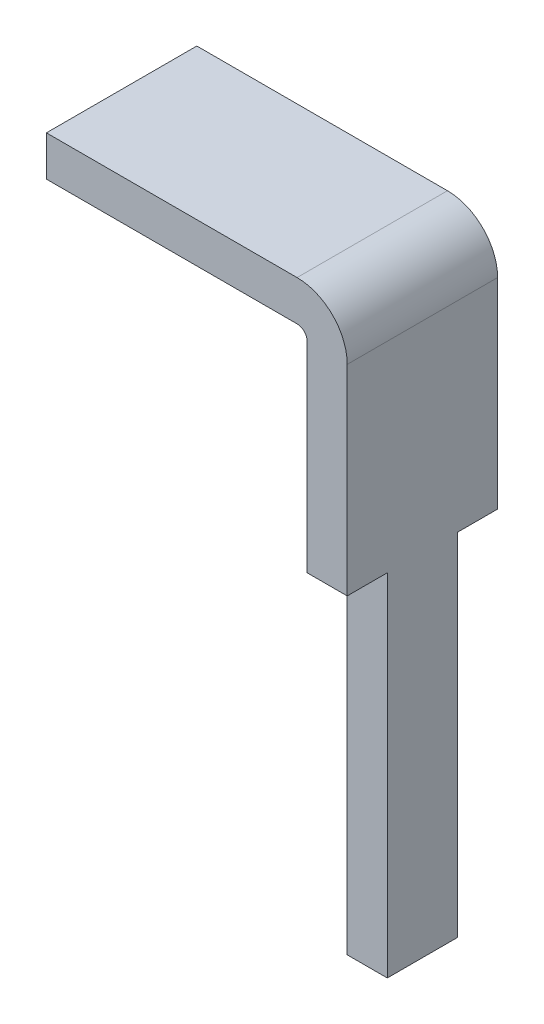
ISO-10303-21;
HEADER;
FILE_DESCRIPTION(('STEP AP214'),'2;1');
FILE_NAME('part.step','',(''),(''),'','','');
FILE_SCHEMA(('AUTOMOTIVE_DESIGN { 1 0 10303 214 1 1 1 1 }'));
ENDSEC;
DATA;
#1=APPLICATION_CONTEXT('core data for automotive mechanical design processes');
#2=APPLICATION_PROTOCOL_DEFINITION('international standard','automotive_design',2000,#1);
#3=PRODUCT_CONTEXT('',#1,'mechanical');
#4=PRODUCT('Part','Part','',(#3));
#5=PRODUCT_RELATED_PRODUCT_CATEGORY('part','',(#4));
#6=PRODUCT_DEFINITION_FORMATION('','',#4);
#7=PRODUCT_DEFINITION_CONTEXT('part definition',#1,'design');
#8=PRODUCT_DEFINITION('design','',#6,#7);
#9=PRODUCT_DEFINITION_SHAPE('','',#8);
#10=(LENGTH_UNIT() NAMED_UNIT(*) SI_UNIT(.MILLI.,.METRE.));
#11=(NAMED_UNIT(*) PLANE_ANGLE_UNIT() SI_UNIT($,.RADIAN.));
#12=(NAMED_UNIT(*) SI_UNIT($,.STERADIAN.) SOLID_ANGLE_UNIT());
#13=UNCERTAINTY_MEASURE_WITH_UNIT(LENGTH_MEASURE(1.E-05),#10,'distance_accuracy_value','');
#14=(GEOMETRIC_REPRESENTATION_CONTEXT(3) GLOBAL_UNCERTAINTY_ASSIGNED_CONTEXT((#13)) GLOBAL_UNIT_ASSIGNED_CONTEXT((#10,
#11,#12)) REPRESENTATION_CONTEXT('',''));
#15=CARTESIAN_POINT('',(0.,0.,0.));
#16=DIRECTION('',(0.,0.,1.));
#17=DIRECTION('',(1.,0.,0.));
#18=AXIS2_PLACEMENT_3D('',#15,#16,#17);
#19=CARTESIAN_POINT('',(0.,0.,1.5));
#20=DIRECTION('',(1.,0.,0.));
#21=DIRECTION('',(0.,0.,-1.));
#22=AXIS2_PLACEMENT_3D('',#19,#20,#21);
#23=PLANE('',#22);
#24=DIRECTION('',(0.,-1.,0.));
#25=VECTOR('',#24,1.);
#26=CARTESIAN_POINT('',(0.,0.,0.));
#27=LINE('',#26,#25);
#28=CARTESIAN_POINT('',(0.,0.,0.));
#29=VERTEX_POINT('',#28);
#30=CARTESIAN_POINT('',(0.,-0.4,0.));
#31=VERTEX_POINT('',#30);
#32=EDGE_CURVE('E179',#29,#31,#27,.T.);
#33=ORIENTED_EDGE('',*,*,#32,.T.);
#34=DIRECTION('',(0.,0.,-1.));
#35=VECTOR('',#34,1.);
#36=CARTESIAN_POINT('',(0.,-0.4,1.5));
#37=LINE('',#36,#35);
#38=CARTESIAN_POINT('',(0.,-0.4,1.5));
#39=VERTEX_POINT('',#38);
#40=EDGE_CURVE('E11',#39,#31,#37,.T.);
#41=ORIENTED_EDGE('',*,*,#40,.F.);
#42=DIRECTION('',(0.,-1.,0.));
#43=VECTOR('',#42,1.);
#44=CARTESIAN_POINT('',(0.,0.,1.5));
#45=LINE('',#44,#43);
#46=CARTESIAN_POINT('',(0.,0.,1.5));
#47=VERTEX_POINT('',#46);
#48=EDGE_CURVE('E151',#47,#39,#45,.T.);
#49=ORIENTED_EDGE('',*,*,#48,.F.);
#50=DIRECTION('',(0.,0.,-1.));
#51=VECTOR('',#50,1.);
#52=CARTESIAN_POINT('',(0.,0.,1.5));
#53=LINE('',#52,#51);
#54=EDGE_CURVE('E152',#47,#29,#53,.T.);
#55=ORIENTED_EDGE('',*,*,#54,.T.);
#56=EDGE_LOOP('',(#33,#41,#49,#55));
#57=FACE_BOUND('',#56,.T.);
#58=ADVANCED_FACE('F32',(#57),#23,.F.);
#59=CARTESIAN_POINT('',(0.,-0.4,1.5));
#60=DIRECTION('',(0.,1.,0.));
#61=DIRECTION('',(0.,0.,1.));
#62=AXIS2_PLACEMENT_3D('',#59,#60,#61);
#63=PLANE('',#62);
#64=DIRECTION('',(1.,0.,0.));
#65=VECTOR('',#64,1.);
#66=CARTESIAN_POINT('',(0.,-0.4,0.));
#67=LINE('',#66,#65);
#68=CARTESIAN_POINT('',(2.5,-0.4,0.));
#69=VERTEX_POINT('',#68);
#70=EDGE_CURVE('E178',#31,#69,#67,.T.);
#71=ORIENTED_EDGE('',*,*,#70,.T.);
#72=DIRECTION('',(0.,0.,-1.));
#73=VECTOR('',#72,1.);
#74=CARTESIAN_POINT('',(2.5,-0.4,1.5));
#75=LINE('',#74,#73);
#76=CARTESIAN_POINT('',(2.5,-0.4,1.5));
#77=VERTEX_POINT('',#76);
#78=EDGE_CURVE('E39',#77,#69,#75,.T.);
#79=ORIENTED_EDGE('',*,*,#78,.F.);
#80=DIRECTION('',(1.,0.,0.));
#81=VECTOR('',#80,1.);
#82=CARTESIAN_POINT('',(0.,-0.4,1.5));
#83=LINE('',#82,#81);
#84=EDGE_CURVE('E194',#39,#77,#83,.T.);
#85=ORIENTED_EDGE('',*,*,#84,.F.);
#86=ORIENTED_EDGE('',*,*,#40,.T.);
#87=EDGE_LOOP('',(#71,#79,#85,#86));
#88=FACE_BOUND('',#87,.T.);
#89=ADVANCED_FACE('F233',(#88),#63,.F.);
#90=CARTESIAN_POINT('',(2.5,-0.5,1.5));
#91=DIRECTION('',(0.,0.,-1.));
#92=DIRECTION('',(-1.,0.,0.));
#93=AXIS2_PLACEMENT_3D('',#90,#91,#92);
#94=CYLINDRICAL_SURFACE('',#93,0.0999999999999999);
#95=CARTESIAN_POINT('',(2.5,-0.5,0.));
#96=DIRECTION('',(0.,0.,-1.));
#97=DIRECTION('',(-1.,0.,0.));
#98=AXIS2_PLACEMENT_3D('',#95,#96,#97);
#99=CIRCLE('',#98,0.0999999999999999);
#100=CARTESIAN_POINT('',(2.6,-0.500000000000001,0.));
#101=VERTEX_POINT('',#100);
#102=EDGE_CURVE('E146',#69,#101,#99,.T.);
#103=ORIENTED_EDGE('',*,*,#102,.T.);
#104=DIRECTION('',(0.,0.,-1.));
#105=VECTOR('',#104,1.);
#106=CARTESIAN_POINT('',(2.6,-0.500000000000001,1.5));
#107=LINE('',#106,#105);
#108=CARTESIAN_POINT('',(2.6,-0.500000000000001,1.5));
#109=VERTEX_POINT('',#108);
#110=EDGE_CURVE('E166',#109,#101,#107,.T.);
#111=ORIENTED_EDGE('',*,*,#110,.F.);
#112=CARTESIAN_POINT('',(2.5,-0.5,1.5));
#113=DIRECTION('',(0.,0.,-1.));
#114=DIRECTION('',(-1.,0.,0.));
#115=AXIS2_PLACEMENT_3D('',#112,#113,#114);
#116=CIRCLE('',#115,0.0999999999999999);
#117=EDGE_CURVE('E175',#77,#109,#116,.T.);
#118=ORIENTED_EDGE('',*,*,#117,.F.);
#119=ORIENTED_EDGE('',*,*,#78,.T.);
#120=EDGE_LOOP('',(#103,#111,#118,#119));
#121=FACE_BOUND('',#120,.T.);
#122=ADVANCED_FACE('F173',(#121),#94,.F.);
#123=CARTESIAN_POINT('',(2.6,-0.500000000000001,1.5));
#124=DIRECTION('',(1.,0.,0.));
#125=DIRECTION('',(0.,0.,-1.));
#126=AXIS2_PLACEMENT_3D('',#123,#124,#125);
#127=PLANE('',#126);
#128=DIRECTION('',(0.,0.,-1.));
#129=VECTOR('',#128,1.);
#130=CARTESIAN_POINT('',(2.6,-2.50000000000001,0.));
#131=LINE('',#130,#129);
#132=CARTESIAN_POINT('',(2.6,-2.50000000000001,0.4));
#133=VERTEX_POINT('',#132);
#134=CARTESIAN_POINT('',(2.6,-2.50000000000001,0.));
#135=VERTEX_POINT('',#134);
#136=EDGE_CURVE('E46',#133,#135,#131,.T.);
#137=ORIENTED_EDGE('',*,*,#136,.F.);
#138=DIRECTION('',(0.,1.,0.));
#139=VECTOR('',#138,1.);
#140=CARTESIAN_POINT('',(2.6,-6.00000000000001,0.4));
#141=LINE('',#140,#139);
#142=CARTESIAN_POINT('',(2.6,-6.00000000000001,0.4));
#143=VERTEX_POINT('',#142);
#144=EDGE_CURVE('E136',#143,#133,#141,.T.);
#145=ORIENTED_EDGE('',*,*,#144,.F.);
#146=DIRECTION('',(0.,0.,-1.));
#147=VECTOR('',#146,1.);
#148=CARTESIAN_POINT('',(2.6,-6.00000000000001,1.5));
#149=LINE('',#148,#147);
#150=CARTESIAN_POINT('',(2.6,-6.00000000000001,1.1));
#151=VERTEX_POINT('',#150);
#152=EDGE_CURVE('E163',#151,#143,#149,.T.);
#153=ORIENTED_EDGE('',*,*,#152,.F.);
#154=DIRECTION('',(0.,-1.,0.));
#155=VECTOR('',#154,1.);
#156=CARTESIAN_POINT('',(2.6,-6.00000000000001,1.1));
#157=LINE('',#156,#155);
#158=CARTESIAN_POINT('',(2.6,-2.50000000000001,1.1));
#159=VERTEX_POINT('',#158);
#160=EDGE_CURVE('E210',#159,#151,#157,.T.);
#161=ORIENTED_EDGE('',*,*,#160,.F.);
#162=DIRECTION('',(0.,0.,-1.));
#163=VECTOR('',#162,1.);
#164=CARTESIAN_POINT('',(2.6,-2.50000000000001,1.5));
#165=LINE('',#164,#163);
#166=CARTESIAN_POINT('',(2.6,-2.50000000000001,1.5));
#167=VERTEX_POINT('',#166);
#168=EDGE_CURVE('E207',#167,#159,#165,.T.);
#169=ORIENTED_EDGE('',*,*,#168,.F.);
#170=DIRECTION('',(0.,-1.,0.));
#171=VECTOR('',#170,1.);
#172=CARTESIAN_POINT('',(2.6,-0.500000000000001,1.5));
#173=LINE('',#172,#171);
#174=EDGE_CURVE('E190',#109,#167,#173,.T.);
#175=ORIENTED_EDGE('',*,*,#174,.F.);
#176=ORIENTED_EDGE('',*,*,#110,.T.);
#177=DIRECTION('',(0.,-1.,0.));
#178=VECTOR('',#177,1.);
#179=CARTESIAN_POINT('',(2.6,-0.500000000000001,0.));
#180=LINE('',#179,#178);
#181=EDGE_CURVE('E142',#101,#135,#180,.T.);
#182=ORIENTED_EDGE('',*,*,#181,.T.);
#183=EDGE_LOOP('',(#137,#145,#153,#161,#169,#175,#176,#182));
#184=FACE_BOUND('',#183,.T.);
#185=ADVANCED_FACE('F224',(#184),#127,.F.);
#186=CARTESIAN_POINT('',(2.6,-6.00000000000001,1.5));
#187=DIRECTION('',(0.,1.,0.));
#188=DIRECTION('',(0.,0.,1.));
#189=AXIS2_PLACEMENT_3D('',#186,#187,#188);
#190=PLANE('',#189);
#191=ORIENTED_EDGE('',*,*,#152,.T.);
#192=DIRECTION('',(1.,0.,0.));
#193=VECTOR('',#192,1.);
#194=CARTESIAN_POINT('',(-0.00100000000000013,-6.00000000000001,0.4));
#195=LINE('',#194,#193);
#196=CARTESIAN_POINT('',(3.,-6.00000000000001,0.4));
#197=VERTEX_POINT('',#196);
#198=EDGE_CURVE('E212',#143,#197,#195,.T.);
#199=ORIENTED_EDGE('',*,*,#198,.T.);
#200=DIRECTION('',(0.,0.,-1.));
#201=VECTOR('',#200,1.);
#202=CARTESIAN_POINT('',(3.,-6.00000000000001,1.5));
#203=LINE('',#202,#201);
#204=CARTESIAN_POINT('',(3.,-6.00000000000001,1.1));
#205=VERTEX_POINT('',#204);
#206=EDGE_CURVE('E161',#205,#197,#203,.T.);
#207=ORIENTED_EDGE('',*,*,#206,.F.);
#208=DIRECTION('',(1.,0.,0.));
#209=VECTOR('',#208,1.);
#210=CARTESIAN_POINT('',(-0.00100000000000013,-6.00000000000001,1.1));
#211=LINE('',#210,#209);
#212=EDGE_CURVE('E198',#151,#205,#211,.T.);
#213=ORIENTED_EDGE('',*,*,#212,.F.);
#214=EDGE_LOOP('',(#191,#199,#207,#213));
#215=FACE_BOUND('',#214,.T.);
#216=ADVANCED_FACE('F248',(#215),#190,.F.);
#217=CARTESIAN_POINT('',(3.,-0.500000000000003,1.5));
#218=DIRECTION('',(-1.,0.,0.));
#219=DIRECTION('',(0.,-1.,0.));
#220=AXIS2_PLACEMENT_3D('',#217,#218,#219);
#221=PLANE('',#220);
#222=ORIENTED_EDGE('',*,*,#206,.T.);
#223=DIRECTION('',(0.,-1.,0.));
#224=VECTOR('',#223,1.);
#225=CARTESIAN_POINT('',(3.,-6.00000000000001,0.4));
#226=LINE('',#225,#224);
#227=CARTESIAN_POINT('',(3.,-2.50000000000001,0.4));
#228=VERTEX_POINT('',#227);
#229=EDGE_CURVE('E128',#228,#197,#226,.T.);
#230=ORIENTED_EDGE('',*,*,#229,.F.);
#231=DIRECTION('',(0.,0.,1.));
#232=VECTOR('',#231,1.);
#233=CARTESIAN_POINT('',(3.,-2.50000000000001,0.));
#234=LINE('',#233,#232);
#235=CARTESIAN_POINT('',(3.,-2.50000000000001,0.));
#236=VERTEX_POINT('',#235);
#237=EDGE_CURVE('E121',#236,#228,#234,.T.);
#238=ORIENTED_EDGE('',*,*,#237,.F.);
#239=DIRECTION('',(0.,1.,0.));
#240=VECTOR('',#239,1.);
#241=CARTESIAN_POINT('',(3.,-0.500000000000003,0.));
#242=LINE('',#241,#240);
#243=CARTESIAN_POINT('',(3.,-0.500000000000003,0.));
#244=VERTEX_POINT('',#243);
#245=EDGE_CURVE('E134',#236,#244,#242,.T.);
#246=ORIENTED_EDGE('',*,*,#245,.T.);
#247=DIRECTION('',(0.,0.,-1.));
#248=VECTOR('',#247,1.);
#249=CARTESIAN_POINT('',(3.,-0.500000000000003,1.5));
#250=LINE('',#249,#248);
#251=CARTESIAN_POINT('',(3.,-0.500000000000003,1.5));
#252=VERTEX_POINT('',#251);
#253=EDGE_CURVE('E159',#252,#244,#250,.T.);
#254=ORIENTED_EDGE('',*,*,#253,.F.);
#255=DIRECTION('',(0.,1.,0.));
#256=VECTOR('',#255,1.);
#257=CARTESIAN_POINT('',(3.,-0.500000000000003,1.5));
#258=LINE('',#257,#256);
#259=CARTESIAN_POINT('',(3.,-2.50000000000001,1.5));
#260=VERTEX_POINT('',#259);
#261=EDGE_CURVE('E188',#260,#252,#258,.T.);
#262=ORIENTED_EDGE('',*,*,#261,.F.);
#263=DIRECTION('',(0.,0.,1.));
#264=VECTOR('',#263,1.);
#265=CARTESIAN_POINT('',(3.,-2.50000000000001,1.5));
#266=LINE('',#265,#264);
#267=CARTESIAN_POINT('',(3.,-2.50000000000001,1.1));
#268=VERTEX_POINT('',#267);
#269=EDGE_CURVE('E54',#268,#260,#266,.T.);
#270=ORIENTED_EDGE('',*,*,#269,.F.);
#271=DIRECTION('',(0.,1.,0.));
#272=VECTOR('',#271,1.);
#273=CARTESIAN_POINT('',(3.,-6.00000000000001,1.1));
#274=LINE('',#273,#272);
#275=EDGE_CURVE('E204',#205,#268,#274,.T.);
#276=ORIENTED_EDGE('',*,*,#275,.F.);
#277=EDGE_LOOP('',(#222,#230,#238,#246,#254,#262,#270,#276));
#278=FACE_BOUND('',#277,.T.);
#279=ADVANCED_FACE('F132',(#278),#221,.F.);
#280=CARTESIAN_POINT('',(2.5,-0.5,1.5));
#281=DIRECTION('',(0.,0.,-1.));
#282=DIRECTION('',(-1.,0.,0.));
#283=AXIS2_PLACEMENT_3D('',#280,#281,#282);
#284=CYLINDRICAL_SURFACE('',#283,0.5);
#285=CARTESIAN_POINT('',(2.5,-0.5,0.));
#286=DIRECTION('',(0.,0.,1.));
#287=DIRECTION('',(-1.,0.,0.));
#288=AXIS2_PLACEMENT_3D('',#285,#286,#287);
#289=CIRCLE('',#288,0.5);
#290=CARTESIAN_POINT('',(2.5,0.,0.));
#291=VERTEX_POINT('',#290);
#292=EDGE_CURVE('E141',#244,#291,#289,.T.);
#293=ORIENTED_EDGE('',*,*,#292,.T.);
#294=DIRECTION('',(0.,0.,-1.));
#295=VECTOR('',#294,1.);
#296=CARTESIAN_POINT('',(2.5,0.,1.5));
#297=LINE('',#296,#295);
#298=CARTESIAN_POINT('',(2.5,0.,1.5));
#299=VERTEX_POINT('',#298);
#300=EDGE_CURVE('E155',#299,#291,#297,.T.);
#301=ORIENTED_EDGE('',*,*,#300,.F.);
#302=CARTESIAN_POINT('',(2.5,-0.5,1.5));
#303=DIRECTION('',(0.,0.,1.));
#304=DIRECTION('',(-1.,0.,0.));
#305=AXIS2_PLACEMENT_3D('',#302,#303,#304);
#306=CIRCLE('',#305,0.5);
#307=EDGE_CURVE('E186',#252,#299,#306,.T.);
#308=ORIENTED_EDGE('',*,*,#307,.F.);
#309=ORIENTED_EDGE('',*,*,#253,.T.);
#310=EDGE_LOOP('',(#293,#301,#308,#309));
#311=FACE_BOUND('',#310,.T.);
#312=ADVANCED_FACE('F242',(#311),#284,.T.);
#313=CARTESIAN_POINT('',(0.,0.,1.5));
#314=DIRECTION('',(0.,-1.,0.));
#315=DIRECTION('',(0.,0.,-1.));
#316=AXIS2_PLACEMENT_3D('',#313,#314,#315);
#317=PLANE('',#316);
#318=DIRECTION('',(-1.,0.,0.));
#319=VECTOR('',#318,1.);
#320=CARTESIAN_POINT('',(0.,0.,0.));
#321=LINE('',#320,#319);
#322=EDGE_CURVE('E144',#291,#29,#321,.T.);
#323=ORIENTED_EDGE('',*,*,#322,.T.);
#324=ORIENTED_EDGE('',*,*,#54,.F.);
#325=DIRECTION('',(-1.,0.,0.));
#326=VECTOR('',#325,1.);
#327=CARTESIAN_POINT('',(0.,0.,1.5));
#328=LINE('',#327,#326);
#329=EDGE_CURVE('E156',#299,#47,#328,.T.);
#330=ORIENTED_EDGE('',*,*,#329,.F.);
#331=ORIENTED_EDGE('',*,*,#300,.T.);
#332=EDGE_LOOP('',(#323,#324,#330,#331));
#333=FACE_BOUND('',#332,.T.);
#334=ADVANCED_FACE('F237',(#333),#317,.F.);
#335=CARTESIAN_POINT('',(2.5,-0.5,1.5));
#336=DIRECTION('',(0.,0.,-1.));
#337=DIRECTION('',(-1.,0.,0.));
#338=AXIS2_PLACEMENT_3D('',#335,#336,#337);
#339=PLANE('',#338);
#340=ORIENTED_EDGE('',*,*,#174,.T.);
#341=DIRECTION('',(1.,0.,0.));
#342=VECTOR('',#341,1.);
#343=CARTESIAN_POINT('',(-0.00100000000000057,-2.50000000000001,1.5));
#344=LINE('',#343,#342);
#345=EDGE_CURVE('E184',#167,#260,#344,.T.);
#346=ORIENTED_EDGE('',*,*,#345,.T.);
#347=ORIENTED_EDGE('',*,*,#261,.T.);
#348=ORIENTED_EDGE('',*,*,#307,.T.);
#349=ORIENTED_EDGE('',*,*,#329,.T.);
#350=ORIENTED_EDGE('',*,*,#48,.T.);
#351=ORIENTED_EDGE('',*,*,#84,.T.);
#352=ORIENTED_EDGE('',*,*,#117,.T.);
#353=EDGE_LOOP('',(#340,#346,#347,#348,#349,#350,#351,#352));
#354=FACE_BOUND('',#353,.T.);
#355=ADVANCED_FACE('F229',(#354),#339,.F.);
#356=CARTESIAN_POINT('',(2.5,-0.5,0.));
#357=DIRECTION('',(0.,0.,-1.));
#358=DIRECTION('',(-1.,0.,0.));
#359=AXIS2_PLACEMENT_3D('',#356,#357,#358);
#360=PLANE('',#359);
#361=DIRECTION('',(1.,0.,0.));
#362=VECTOR('',#361,1.);
#363=CARTESIAN_POINT('',(-0.00100000000000057,-2.50000000000001,0.));
#364=LINE('',#363,#362);
#365=EDGE_CURVE('E118',#135,#236,#364,.T.);
#366=ORIENTED_EDGE('',*,*,#365,.F.);
#367=ORIENTED_EDGE('',*,*,#181,.F.);
#368=ORIENTED_EDGE('',*,*,#102,.F.);
#369=ORIENTED_EDGE('',*,*,#70,.F.);
#370=ORIENTED_EDGE('',*,*,#32,.F.);
#371=ORIENTED_EDGE('',*,*,#322,.F.);
#372=ORIENTED_EDGE('',*,*,#292,.F.);
#373=ORIENTED_EDGE('',*,*,#245,.F.);
#374=EDGE_LOOP('',(#366,#367,#368,#369,#370,#371,#372,#373));
#375=FACE_BOUND('',#374,.T.);
#376=ADVANCED_FACE('F139',(#375),#360,.T.);
#377=CARTESIAN_POINT('',(-0.00100000000000057,-2.50000000000001,1.5));
#378=DIRECTION('',(0.,1.,0.));
#379=DIRECTION('',(-1.,0.,0.));
#380=AXIS2_PLACEMENT_3D('',#377,#378,#379);
#381=PLANE('',#380);
#382=ORIENTED_EDGE('',*,*,#168,.T.);
#383=DIRECTION('',(1.,0.,0.));
#384=VECTOR('',#383,1.);
#385=CARTESIAN_POINT('',(-0.00100000000000057,-2.50000000000001,1.1));
#386=LINE('',#385,#384);
#387=EDGE_CURVE('E200',#159,#268,#386,.T.);
#388=ORIENTED_EDGE('',*,*,#387,.T.);
#389=ORIENTED_EDGE('',*,*,#269,.T.);
#390=ORIENTED_EDGE('',*,*,#345,.F.);
#391=EDGE_LOOP('',(#382,#388,#389,#390));
#392=FACE_BOUND('',#391,.T.);
#393=ADVANCED_FACE('F250',(#392),#381,.F.);
#394=CARTESIAN_POINT('',(-0.00100000000000013,-6.00000000000001,1.1));
#395=DIRECTION('',(0.,0.,-1.));
#396=DIRECTION('',(-1.,0.,0.));
#397=AXIS2_PLACEMENT_3D('',#394,#395,#396);
#398=PLANE('',#397);
#399=ORIENTED_EDGE('',*,*,#160,.T.);
#400=ORIENTED_EDGE('',*,*,#212,.T.);
#401=ORIENTED_EDGE('',*,*,#275,.T.);
#402=ORIENTED_EDGE('',*,*,#387,.F.);
#403=EDGE_LOOP('',(#399,#400,#401,#402));
#404=FACE_BOUND('',#403,.T.);
#405=ADVANCED_FACE('F249',(#404),#398,.F.);
#406=CARTESIAN_POINT('',(-0.00100000000000013,-6.00000000000001,0.4));
#407=DIRECTION('',(0.,0.,1.));
#408=DIRECTION('',(1.,0.,0.));
#409=AXIS2_PLACEMENT_3D('',#406,#407,#408);
#410=PLANE('',#409);
#411=ORIENTED_EDGE('',*,*,#144,.T.);
#412=DIRECTION('',(1.,0.,0.));
#413=VECTOR('',#412,1.);
#414=CARTESIAN_POINT('',(-0.00100000000000057,-2.50000000000001,0.4));
#415=LINE('',#414,#413);
#416=EDGE_CURVE('E127',#133,#228,#415,.T.);
#417=ORIENTED_EDGE('',*,*,#416,.T.);
#418=ORIENTED_EDGE('',*,*,#229,.T.);
#419=ORIENTED_EDGE('',*,*,#198,.F.);
#420=EDGE_LOOP('',(#411,#417,#418,#419));
#421=FACE_BOUND('',#420,.T.);
#422=ADVANCED_FACE('F221',(#421),#410,.F.);
#423=CARTESIAN_POINT('',(-0.00100000000000057,-2.50000000000001,0.));
#424=DIRECTION('',(0.,1.,0.));
#425=DIRECTION('',(-1.,0.,0.));
#426=AXIS2_PLACEMENT_3D('',#423,#424,#425);
#427=PLANE('',#426);
#428=ORIENTED_EDGE('',*,*,#136,.T.);
#429=ORIENTED_EDGE('',*,*,#365,.T.);
#430=ORIENTED_EDGE('',*,*,#237,.T.);
#431=ORIENTED_EDGE('',*,*,#416,.F.);
#432=EDGE_LOOP('',(#428,#429,#430,#431));
#433=FACE_BOUND('',#432,.T.);
#434=ADVANCED_FACE('F120',(#433),#427,.F.);
#435=CLOSED_SHELL('',(#58,#89,#122,#185,#216,#279,#312,#334,#355,#376,#393,#405,#422,#434));
#436=MANIFOLD_SOLID_BREP('B2',#435);
#437=ADVANCED_BREP_SHAPE_REPRESENTATION('',(#18,#436),#14);
#438=SHAPE_DEFINITION_REPRESENTATION(#9,#437);
ENDSEC;
END-ISO-10303-21;
